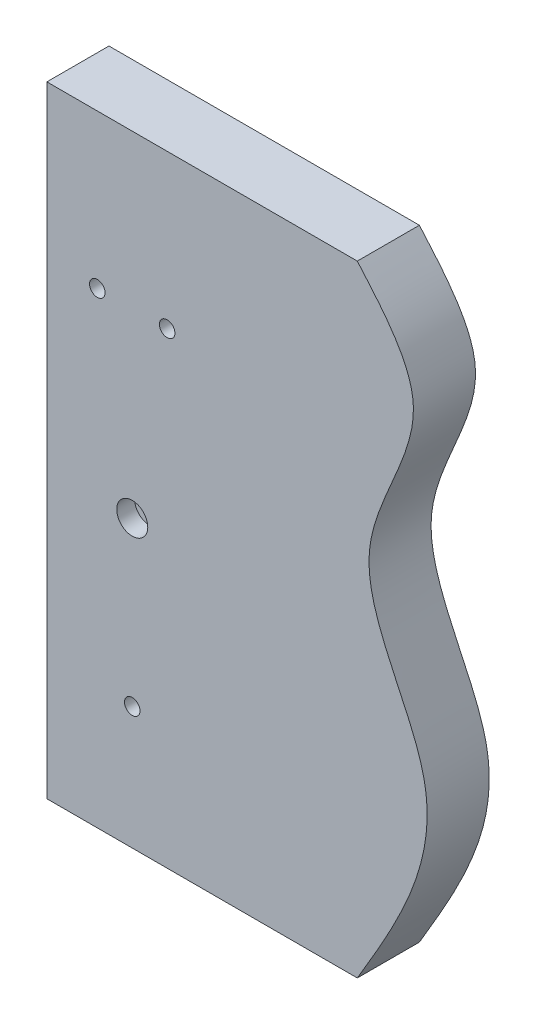
ISO-10303-21;
HEADER;
FILE_DESCRIPTION(('STEP AP214'),'2;1');
FILE_NAME('part.step','',(''),(''),'','','');
FILE_SCHEMA(('AUTOMOTIVE_DESIGN { 1 0 10303 214 1 1 1 1 }'));
ENDSEC;
DATA;
#1=APPLICATION_CONTEXT('core data for automotive mechanical design processes');
#2=APPLICATION_PROTOCOL_DEFINITION('international standard','automotive_design',2000,#1);
#3=PRODUCT_CONTEXT('',#1,'mechanical');
#4=PRODUCT('Part','Part','',(#3));
#5=PRODUCT_RELATED_PRODUCT_CATEGORY('part','',(#4));
#6=PRODUCT_DEFINITION_FORMATION('','',#4);
#7=PRODUCT_DEFINITION_CONTEXT('part definition',#1,'design');
#8=PRODUCT_DEFINITION('design','',#6,#7);
#9=PRODUCT_DEFINITION_SHAPE('','',#8);
#10=(LENGTH_UNIT() NAMED_UNIT(*) SI_UNIT(.MILLI.,.METRE.));
#11=(NAMED_UNIT(*) PLANE_ANGLE_UNIT() SI_UNIT($,.RADIAN.));
#12=(NAMED_UNIT(*) SI_UNIT($,.STERADIAN.) SOLID_ANGLE_UNIT());
#13=UNCERTAINTY_MEASURE_WITH_UNIT(LENGTH_MEASURE(1.E-05),#10,'distance_accuracy_value','');
#14=(GEOMETRIC_REPRESENTATION_CONTEXT(3) GLOBAL_UNCERTAINTY_ASSIGNED_CONTEXT((#13)) GLOBAL_UNIT_ASSIGNED_CONTEXT((#10,
#11,#12)) REPRESENTATION_CONTEXT('',''));
#15=CARTESIAN_POINT('',(0.,0.,0.));
#16=DIRECTION('',(0.,0.,1.));
#17=DIRECTION('',(1.,0.,0.));
#18=AXIS2_PLACEMENT_3D('',#15,#16,#17);
#19=CARTESIAN_POINT('',(-147.,-116.5,-8.5));
#20=DIRECTION('',(0.,-1.,0.));
#21=DIRECTION('',(1.,0.,0.));
#22=AXIS2_PLACEMENT_3D('',#19,#20,#21);
#23=PLANE('',#22);
#24=DIRECTION('',(1.,0.,0.));
#25=VECTOR('',#24,1.);
#26=CARTESIAN_POINT('',(-147.,-116.5,-8.5));
#27=LINE('',#26,#25);
#28=CARTESIAN_POINT('',(-92.8205505282296,-116.5,-8.5));
#29=VERTEX_POINT('',#28);
#30=CARTESIAN_POINT('',(-70.,-116.5,-8.5));
#31=VERTEX_POINT('',#30);
#32=EDGE_CURVE('E142',#29,#31,#27,.T.);
#33=ORIENTED_EDGE('',*,*,#32,.F.);
#34=DIRECTION('',(0.,0.,1.));
#35=VECTOR('',#34,1.);
#36=CARTESIAN_POINT('',(-92.8205505282296,-116.5,-20.));
#37=LINE('',#36,#35);
#38=CARTESIAN_POINT('',(-92.8205505282296,-116.5,8.5));
#39=VERTEX_POINT('',#38);
#40=EDGE_CURVE('E134',#29,#39,#37,.T.);
#41=ORIENTED_EDGE('',*,*,#40,.T.);
#42=DIRECTION('',(1.,0.,0.));
#43=VECTOR('',#42,1.);
#44=CARTESIAN_POINT('',(-147.,-116.5,8.5));
#45=LINE('',#44,#43);
#46=CARTESIAN_POINT('',(-70.,-116.5,8.5));
#47=VERTEX_POINT('',#46);
#48=EDGE_CURVE('E140',#39,#47,#45,.T.);
#49=ORIENTED_EDGE('',*,*,#48,.T.);
#50=DIRECTION('',(0.,0.,1.));
#51=VECTOR('',#50,1.);
#52=CARTESIAN_POINT('',(-70.,-116.5,-8.5));
#53=LINE('',#52,#51);
#54=EDGE_CURVE('E173',#31,#47,#53,.T.);
#55=ORIENTED_EDGE('',*,*,#54,.F.);
#56=EDGE_LOOP('',(#33,#41,#49,#55));
#57=FACE_BOUND('',#56,.T.);
#58=ADVANCED_FACE('F33',(#57),#23,.F.);
#59=CARTESIAN_POINT('',(-147.,-150.,-11.));
#60=DIRECTION('',(-1.,0.,0.));
#61=DIRECTION('',(0.,0.,1.));
#62=AXIS2_PLACEMENT_3D('',#59,#60,#61);
#63=PLANE('',#62);
#64=DIRECTION('',(0.,-1.,0.));
#65=VECTOR('',#64,1.);
#66=CARTESIAN_POINT('',(-147.,80.,-11.));
#67=LINE('',#66,#65);
#68=CARTESIAN_POINT('',(-147.,80.,-11.));
#69=VERTEX_POINT('',#68);
#70=CARTESIAN_POINT('',(-147.,-150.,-11.));
#71=VERTEX_POINT('',#70);
#72=EDGE_CURVE('E175',#69,#71,#67,.T.);
#73=ORIENTED_EDGE('',*,*,#72,.T.);
#74=DIRECTION('',(0.,0.,1.));
#75=VECTOR('',#74,1.);
#76=CARTESIAN_POINT('',(-147.,-150.,-11.));
#77=LINE('',#76,#75);
#78=CARTESIAN_POINT('',(-147.,-150.,11.));
#79=VERTEX_POINT('',#78);
#80=EDGE_CURVE('E178',#71,#79,#77,.T.);
#81=ORIENTED_EDGE('',*,*,#80,.T.);
#82=DIRECTION('',(0.,1.,0.));
#83=VECTOR('',#82,1.);
#84=CARTESIAN_POINT('',(-147.,80.,11.));
#85=LINE('',#84,#83);
#86=CARTESIAN_POINT('',(-147.,80.,11.));
#87=VERTEX_POINT('',#86);
#88=EDGE_CURVE('E182',#79,#87,#85,.T.);
#89=ORIENTED_EDGE('',*,*,#88,.T.);
#90=DIRECTION('',(0.,0.,-1.));
#91=VECTOR('',#90,1.);
#92=CARTESIAN_POINT('',(-147.,80.,-11.));
#93=LINE('',#92,#91);
#94=EDGE_CURVE('E185',#87,#69,#93,.T.);
#95=ORIENTED_EDGE('',*,*,#94,.T.);
#96=EDGE_LOOP('',(#73,#81,#89,#95));
#97=FACE_BOUND('',#96,.T.);
#98=DIRECTION('',(0.,0.,1.));
#99=VECTOR('',#98,1.);
#100=CARTESIAN_POINT('',(-147.,-116.5,-8.5));
#101=LINE('',#100,#99);
#102=CARTESIAN_POINT('',(-147.,-116.5,-8.5));
#103=VERTEX_POINT('',#102);
#104=CARTESIAN_POINT('',(-147.,-116.5,8.5));
#105=VERTEX_POINT('',#104);
#106=EDGE_CURVE('E165',#103,#105,#101,.T.);
#107=ORIENTED_EDGE('',*,*,#106,.F.);
#108=DIRECTION('',(0.,-1.,0.));
#109=VECTOR('',#108,1.);
#110=CARTESIAN_POINT('',(-147.,-116.5,-8.5));
#111=LINE('',#110,#109);
#112=CARTESIAN_POINT('',(-147.,46.5,-8.5));
#113=VERTEX_POINT('',#112);
#114=EDGE_CURVE('E157',#113,#103,#111,.T.);
#115=ORIENTED_EDGE('',*,*,#114,.F.);
#116=DIRECTION('',(0.,0.,1.));
#117=VECTOR('',#116,1.);
#118=CARTESIAN_POINT('',(-147.,46.5,-8.5));
#119=LINE('',#118,#117);
#120=CARTESIAN_POINT('',(-147.,46.5,8.5));
#121=VERTEX_POINT('',#120);
#122=EDGE_CURVE('E168',#113,#121,#119,.T.);
#123=ORIENTED_EDGE('',*,*,#122,.T.);
#124=DIRECTION('',(0.,-1.,0.));
#125=VECTOR('',#124,1.);
#126=CARTESIAN_POINT('',(-147.,-116.5,8.5));
#127=LINE('',#126,#125);
#128=EDGE_CURVE('E162',#121,#105,#127,.T.);
#129=ORIENTED_EDGE('',*,*,#128,.T.);
#130=EDGE_LOOP('',(#107,#115,#123,#129));
#131=FACE_BOUND('',#130,.T.);
#132=ADVANCED_FACE('F236',(#97,#131),#63,.T.);
#133=CARTESIAN_POINT('',(-150.,200.,20.));
#134=DIRECTION('',(1.,0.,0.));
#135=DIRECTION('',(0.,0.,-1.));
#136=AXIS2_PLACEMENT_3D('',#133,#134,#135);
#137=PLANE('',#136);
#138=DIRECTION('',(0.,0.,1.));
#139=VECTOR('',#138,1.);
#140=CARTESIAN_POINT('',(-150.,-150.,-11.));
#141=LINE('',#140,#139);
#142=CARTESIAN_POINT('',(-150.,-150.,-11.));
#143=VERTEX_POINT('',#142);
#144=CARTESIAN_POINT('',(-150.,-150.,11.));
#145=VERTEX_POINT('',#144);
#146=EDGE_CURVE('E190',#143,#145,#141,.T.);
#147=ORIENTED_EDGE('',*,*,#146,.F.);
#148=DIRECTION('',(0.,-1.,0.));
#149=VECTOR('',#148,1.);
#150=CARTESIAN_POINT('',(-150.,80.,-11.));
#151=LINE('',#150,#149);
#152=CARTESIAN_POINT('',(-150.,80.,-11.));
#153=VERTEX_POINT('',#152);
#154=EDGE_CURVE('E167',#153,#143,#151,.T.);
#155=ORIENTED_EDGE('',*,*,#154,.F.);
#156=DIRECTION('',(0.,0.,-1.));
#157=VECTOR('',#156,1.);
#158=CARTESIAN_POINT('',(-150.,80.,-11.));
#159=LINE('',#158,#157);
#160=CARTESIAN_POINT('',(-150.,80.,11.));
#161=VERTEX_POINT('',#160);
#162=EDGE_CURVE('E179',#161,#153,#159,.T.);
#163=ORIENTED_EDGE('',*,*,#162,.F.);
#164=DIRECTION('',(0.,1.,0.));
#165=VECTOR('',#164,1.);
#166=CARTESIAN_POINT('',(-150.,80.,11.));
#167=LINE('',#166,#165);
#168=EDGE_CURVE('E193',#145,#161,#167,.T.);
#169=ORIENTED_EDGE('',*,*,#168,.F.);
#170=EDGE_LOOP('',(#147,#155,#163,#169));
#171=FACE_BOUND('',#170,.T.);
#172=DIRECTION('',(0.,-1.,0.));
#173=VECTOR('',#172,1.);
#174=CARTESIAN_POINT('',(-150.,200.,-20.));
#175=LINE('',#174,#173);
#176=CARTESIAN_POINT('',(-150.,200.,-20.));
#177=VERTEX_POINT('',#176);
#178=CARTESIAN_POINT('',(-150.,-200.,-20.));
#179=VERTEX_POINT('',#178);
#180=EDGE_CURVE('E200',#177,#179,#175,.T.);
#181=ORIENTED_EDGE('',*,*,#180,.T.);
#182=DIRECTION('',(0.,0.,-1.));
#183=VECTOR('',#182,1.);
#184=CARTESIAN_POINT('',(-150.,-200.,20.));
#185=LINE('',#184,#183);
#186=CARTESIAN_POINT('',(-150.,-200.,20.));
#187=VERTEX_POINT('',#186);
#188=EDGE_CURVE('E41',#187,#179,#185,.T.);
#189=ORIENTED_EDGE('',*,*,#188,.F.);
#190=DIRECTION('',(0.,-1.,0.));
#191=VECTOR('',#190,1.);
#192=CARTESIAN_POINT('',(-150.,200.,20.));
#193=LINE('',#192,#191);
#194=CARTESIAN_POINT('',(-150.,200.,20.));
#195=VERTEX_POINT('',#194);
#196=EDGE_CURVE('E207',#195,#187,#193,.T.);
#197=ORIENTED_EDGE('',*,*,#196,.F.);
#198=DIRECTION('',(0.,0.,-1.));
#199=VECTOR('',#198,1.);
#200=CARTESIAN_POINT('',(-150.,200.,20.));
#201=LINE('',#200,#199);
#202=EDGE_CURVE('E431',#195,#177,#201,.T.);
#203=ORIENTED_EDGE('',*,*,#202,.T.);
#204=EDGE_LOOP('',(#181,#189,#197,#203));
#205=FACE_BOUND('',#204,.T.);
#206=ADVANCED_FACE('F35',(#171,#205),#137,.F.);
#207=CARTESIAN_POINT('',(-150.,-200.,20.));
#208=DIRECTION('',(0.,1.,0.));
#209=DIRECTION('',(0.,0.,1.));
#210=AXIS2_PLACEMENT_3D('',#207,#208,#209);
#211=PLANE('',#210);
#212=DIRECTION('',(1.,0.,0.));
#213=VECTOR('',#212,1.);
#214=CARTESIAN_POINT('',(-150.,-200.,-20.));
#215=LINE('',#214,#213);
#216=CARTESIAN_POINT('',(50.,-200.,-20.));
#217=VERTEX_POINT('',#216);
#218=EDGE_CURVE('E420',#179,#217,#215,.T.);
#219=ORIENTED_EDGE('',*,*,#218,.T.);
#220=DIRECTION('',(0.,0.,-1.));
#221=VECTOR('',#220,1.);
#222=CARTESIAN_POINT('',(50.,-200.,20.));
#223=LINE('',#222,#221);
#224=CARTESIAN_POINT('',(50.,-200.,20.));
#225=VERTEX_POINT('',#224);
#226=EDGE_CURVE('E334',#225,#217,#223,.T.);
#227=ORIENTED_EDGE('',*,*,#226,.F.);
#228=DIRECTION('',(1.,0.,0.));
#229=VECTOR('',#228,1.);
#230=CARTESIAN_POINT('',(-150.,-200.,20.));
#231=LINE('',#230,#229);
#232=EDGE_CURVE('E210',#187,#225,#231,.T.);
#233=ORIENTED_EDGE('',*,*,#232,.F.);
#234=ORIENTED_EDGE('',*,*,#188,.T.);
#235=EDGE_LOOP('',(#219,#227,#233,#234));
#236=FACE_BOUND('',#235,.T.);
#237=ADVANCED_FACE('F228',(#236),#211,.F.);
#238=CARTESIAN_POINT('',(50.,-200.,20.));
#239=CARTESIAN_POINT('',(75.8926121429316,-156.299492504264,20.));
#240=CARTESIAN_POINT('',(123.473848535243,-75.9937988901806,20.));
#241=CARTESIAN_POINT('',(27.2782564010871,35.2365570661427,20.));
#242=CARTESIAN_POINT('',(108.79400955081,132.296562906832,20.));
#243=CARTESIAN_POINT('',(66.8795606617927,180.562572919298,20.));
#244=CARTESIAN_POINT('',(50.,200.,20.));
#245=B_SPLINE_CURVE_WITH_KNOTS('',3,(#238,#239,#240,#241,#242,#243,#244),.UNSPECIFIED.,.F.,.F.,
(4,1,1,1,4),(0.,0.322833315670229,0.593250623900925,0.836196086314051,1.),.UNSPECIFIED.);
#246=DIRECTION('',(0.,0.,-1.));
#247=VECTOR('',#246,1.);
#248=SURFACE_OF_LINEAR_EXTRUSION('',#245,#247);
#249=CARTESIAN_POINT('',(50.,-200.,-20.));
#250=CARTESIAN_POINT('',(75.8926121429316,-156.299492504264,-20.));
#251=CARTESIAN_POINT('',(123.473848535243,-75.9937988901806,-20.));
#252=CARTESIAN_POINT('',(27.2782564010871,35.2365570661427,-20.));
#253=CARTESIAN_POINT('',(108.79400955081,132.296562906832,-20.));
#254=CARTESIAN_POINT('',(66.8795606617927,180.562572919298,-20.));
#255=CARTESIAN_POINT('',(50.,200.,-20.));
#256=B_SPLINE_CURVE_WITH_KNOTS('',3,(#249,#250,#251,#252,#253,#254,#255),.UNSPECIFIED.,.F.,.F.,
(4,1,1,1,4),(0.,0.322833315670229,0.593250623900925,0.836196086314051,1.),.UNSPECIFIED.);
#257=CARTESIAN_POINT('',(50.,200.,-20.));
#258=VERTEX_POINT('',#257);
#259=EDGE_CURVE('E421',#217,#258,#256,.T.);
#260=ORIENTED_EDGE('',*,*,#259,.T.);
#261=DIRECTION('',(0.,0.,-1.));
#262=VECTOR('',#261,1.);
#263=CARTESIAN_POINT('',(50.,200.,20.));
#264=LINE('',#263,#262);
#265=CARTESIAN_POINT('',(50.,200.,20.));
#266=VERTEX_POINT('',#265);
#267=EDGE_CURVE('E337',#266,#258,#264,.T.);
#268=ORIENTED_EDGE('',*,*,#267,.F.);
#269=EDGE_CURVE('E213',#225,#266,#245,.T.);
#270=ORIENTED_EDGE('',*,*,#269,.F.);
#271=ORIENTED_EDGE('',*,*,#226,.T.);
#272=EDGE_LOOP('',(#260,#268,#270,#271));
#273=FACE_BOUND('',#272,.T.);
#274=ADVANCED_FACE('F224',(#273),#248,.F.);
#275=CARTESIAN_POINT('',(-150.,200.,20.));
#276=DIRECTION('',(0.,-1.,0.));
#277=DIRECTION('',(0.,0.,-1.));
#278=AXIS2_PLACEMENT_3D('',#275,#276,#277);
#279=PLANE('',#278);
#280=DIRECTION('',(-1.,0.,0.));
#281=VECTOR('',#280,1.);
#282=CARTESIAN_POINT('',(-150.,200.,-20.));
#283=LINE('',#282,#281);
#284=EDGE_CURVE('E211',#258,#177,#283,.T.);
#285=ORIENTED_EDGE('',*,*,#284,.T.);
#286=ORIENTED_EDGE('',*,*,#202,.F.);
#287=DIRECTION('',(-1.,0.,0.));
#288=VECTOR('',#287,1.);
#289=CARTESIAN_POINT('',(-150.,200.,20.));
#290=LINE('',#289,#288);
#291=EDGE_CURVE('E218',#266,#195,#290,.T.);
#292=ORIENTED_EDGE('',*,*,#291,.F.);
#293=ORIENTED_EDGE('',*,*,#267,.T.);
#294=EDGE_LOOP('',(#285,#286,#292,#293));
#295=FACE_BOUND('',#294,.T.);
#296=ADVANCED_FACE('F227',(#295),#279,.F.);
#297=CARTESIAN_POINT('',(64.7438582512238,2.07966306238669,20.));
#298=DIRECTION('',(0.,0.,1.));
#299=DIRECTION('',(1.,0.,0.));
#300=AXIS2_PLACEMENT_3D('',#297,#298,#299);
#301=PLANE('',#300);
#302=CARTESIAN_POINT('',(-72.5,101.,20.));
#303=DIRECTION('',(0.,0.,1.));
#304=DIRECTION('',(1.,0.,0.));
#305=AXIS2_PLACEMENT_3D('',#302,#303,#304);
#306=CIRCLE('',#305,5.00000000000001);
#307=CARTESIAN_POINT('',(-67.5,101.,20.));
#308=VERTEX_POINT('',#307);
#309=EDGE_CURVE('E299',#308,#308,#306,.T.);
#310=ORIENTED_EDGE('',*,*,#309,.F.);
#311=EDGE_LOOP('',(#310));
#312=FACE_BOUND('',#311,.T.);
#313=CARTESIAN_POINT('',(-95.,-121.,20.));
#314=DIRECTION('',(0.,0.,1.));
#315=DIRECTION('',(1.,0.,0.));
#316=AXIS2_PLACEMENT_3D('',#313,#314,#315);
#317=CIRCLE('',#316,5.00000000000001);
#318=CARTESIAN_POINT('',(-90.,-121.,20.));
#319=VERTEX_POINT('',#318);
#320=EDGE_CURVE('E293',#319,#319,#317,.T.);
#321=ORIENTED_EDGE('',*,*,#320,.F.);
#322=EDGE_LOOP('',(#321));
#323=FACE_BOUND('',#322,.T.);
#324=CARTESIAN_POINT('',(-117.5,101.,20.));
#325=DIRECTION('',(0.,0.,1.));
#326=DIRECTION('',(1.,0.,0.));
#327=AXIS2_PLACEMENT_3D('',#324,#325,#326);
#328=CIRCLE('',#327,5.00000000000001);
#329=CARTESIAN_POINT('',(-112.5,101.,20.));
#330=VERTEX_POINT('',#329);
#331=EDGE_CURVE('E285',#330,#330,#328,.T.);
#332=ORIENTED_EDGE('',*,*,#331,.F.);
#333=EDGE_LOOP('',(#332));
#334=FACE_BOUND('',#333,.T.);
#335=CARTESIAN_POINT('',(-95.,-16.,20.));
#336=DIRECTION('',(0.,0.,1.));
#337=DIRECTION('',(1.,0.,0.));
#338=AXIS2_PLACEMENT_3D('',#335,#336,#337);
#339=CIRCLE('',#338,9.99999999999999);
#340=CARTESIAN_POINT('',(-85.,-16.,20.));
#341=VERTEX_POINT('',#340);
#342=EDGE_CURVE('E278',#341,#341,#339,.T.);
#343=ORIENTED_EDGE('',*,*,#342,.F.);
#344=EDGE_LOOP('',(#343));
#345=FACE_BOUND('',#344,.T.);
#346=ORIENTED_EDGE('',*,*,#196,.T.);
#347=ORIENTED_EDGE('',*,*,#232,.T.);
#348=ORIENTED_EDGE('',*,*,#269,.T.);
#349=ORIENTED_EDGE('',*,*,#291,.T.);
#350=EDGE_LOOP('',(#346,#347,#348,#349));
#351=FACE_BOUND('',#350,.T.);
#352=ADVANCED_FACE('F314',(#312,#323,#334,#345,#351),#301,.T.);
#353=CARTESIAN_POINT('',(64.7438582512238,2.07966306238669,-20.));
#354=DIRECTION('',(0.,0.,1.));
#355=DIRECTION('',(1.,0.,0.));
#356=AXIS2_PLACEMENT_3D('',#353,#354,#355);
#357=PLANE('',#356);
#358=CARTESIAN_POINT('',(-72.5,101.,-20.));
#359=DIRECTION('',(0.,0.,1.));
#360=DIRECTION('',(1.,0.,0.));
#361=AXIS2_PLACEMENT_3D('',#358,#359,#360);
#362=CIRCLE('',#361,5.00000000000001);
#363=CARTESIAN_POINT('',(-67.5,101.,-20.));
#364=VERTEX_POINT('',#363);
#365=EDGE_CURVE('E296',#364,#364,#362,.T.);
#366=ORIENTED_EDGE('',*,*,#365,.T.);
#367=EDGE_LOOP('',(#366));
#368=FACE_BOUND('',#367,.T.);
#369=CARTESIAN_POINT('',(-95.,-121.,-20.));
#370=DIRECTION('',(0.,0.,1.));
#371=DIRECTION('',(1.,0.,0.));
#372=AXIS2_PLACEMENT_3D('',#369,#370,#371);
#373=CIRCLE('',#372,5.00000000000001);
#374=CARTESIAN_POINT('',(-90.,-121.,-20.));
#375=VERTEX_POINT('',#374);
#376=EDGE_CURVE('E292',#375,#375,#373,.T.);
#377=ORIENTED_EDGE('',*,*,#376,.T.);
#378=EDGE_LOOP('',(#377));
#379=FACE_BOUND('',#378,.T.);
#380=CARTESIAN_POINT('',(-117.5,101.,-20.));
#381=DIRECTION('',(0.,0.,1.));
#382=DIRECTION('',(1.,0.,0.));
#383=AXIS2_PLACEMENT_3D('',#380,#381,#382);
#384=CIRCLE('',#383,5.00000000000001);
#385=CARTESIAN_POINT('',(-112.5,101.,-20.));
#386=VERTEX_POINT('',#385);
#387=EDGE_CURVE('E282',#386,#386,#384,.T.);
#388=ORIENTED_EDGE('',*,*,#387,.T.);
#389=EDGE_LOOP('',(#388));
#390=FACE_BOUND('',#389,.T.);
#391=CARTESIAN_POINT('',(-95.,-16.,-20.));
#392=DIRECTION('',(0.,0.,1.));
#393=DIRECTION('',(1.,0.,0.));
#394=AXIS2_PLACEMENT_3D('',#391,#392,#393);
#395=CIRCLE('',#394,9.99999999999999);
#396=CARTESIAN_POINT('',(-85.,-16.,-20.));
#397=VERTEX_POINT('',#396);
#398=EDGE_CURVE('E281',#397,#397,#395,.T.);
#399=ORIENTED_EDGE('',*,*,#398,.T.);
#400=EDGE_LOOP('',(#399));
#401=FACE_BOUND('',#400,.T.);
#402=ORIENTED_EDGE('',*,*,#180,.F.);
#403=ORIENTED_EDGE('',*,*,#284,.F.);
#404=ORIENTED_EDGE('',*,*,#259,.F.);
#405=ORIENTED_EDGE('',*,*,#218,.F.);
#406=EDGE_LOOP('',(#402,#403,#404,#405));
#407=FACE_BOUND('',#406,.T.);
#408=ADVANCED_FACE('F305',(#368,#379,#390,#401,#407),#357,.F.);
#409=CARTESIAN_POINT('',(-147.,80.,-11.));
#410=DIRECTION('',(0.,0.,-1.));
#411=DIRECTION('',(0.,1.,0.));
#412=AXIS2_PLACEMENT_3D('',#409,#410,#411);
#413=PLANE('',#412);
#414=ORIENTED_EDGE('',*,*,#154,.T.);
#415=DIRECTION('',(-1.,0.,0.));
#416=VECTOR('',#415,1.);
#417=CARTESIAN_POINT('',(-147.,-150.,-11.));
#418=LINE('',#417,#416);
#419=EDGE_CURVE('E188',#71,#143,#418,.T.);
#420=ORIENTED_EDGE('',*,*,#419,.F.);
#421=ORIENTED_EDGE('',*,*,#72,.F.);
#422=DIRECTION('',(-1.,0.,0.));
#423=VECTOR('',#422,1.);
#424=CARTESIAN_POINT('',(-147.,80.,-11.));
#425=LINE('',#424,#423);
#426=EDGE_CURVE('E198',#69,#153,#425,.T.);
#427=ORIENTED_EDGE('',*,*,#426,.T.);
#428=EDGE_LOOP('',(#414,#420,#421,#427));
#429=FACE_BOUND('',#428,.T.);
#430=ADVANCED_FACE('F415',(#429),#413,.F.);
#431=CARTESIAN_POINT('',(-147.,80.,-11.));
#432=DIRECTION('',(0.,1.,0.));
#433=DIRECTION('',(-1.,0.,0.));
#434=AXIS2_PLACEMENT_3D('',#431,#432,#433);
#435=PLANE('',#434);
#436=ORIENTED_EDGE('',*,*,#162,.T.);
#437=ORIENTED_EDGE('',*,*,#426,.F.);
#438=ORIENTED_EDGE('',*,*,#94,.F.);
#439=DIRECTION('',(-1.,0.,0.));
#440=VECTOR('',#439,1.);
#441=CARTESIAN_POINT('',(-147.,80.,11.));
#442=LINE('',#441,#440);
#443=EDGE_CURVE('E201',#87,#161,#442,.T.);
#444=ORIENTED_EDGE('',*,*,#443,.T.);
#445=EDGE_LOOP('',(#436,#437,#438,#444));
#446=FACE_BOUND('',#445,.T.);
#447=ADVANCED_FACE('F456',(#446),#435,.F.);
#448=CARTESIAN_POINT('',(-147.,80.,11.));
#449=DIRECTION('',(0.,0.,1.));
#450=DIRECTION('',(0.,-1.,0.));
#451=AXIS2_PLACEMENT_3D('',#448,#449,#450);
#452=PLANE('',#451);
#453=ORIENTED_EDGE('',*,*,#168,.T.);
#454=ORIENTED_EDGE('',*,*,#443,.F.);
#455=ORIENTED_EDGE('',*,*,#88,.F.);
#456=DIRECTION('',(-1.,0.,0.));
#457=VECTOR('',#456,1.);
#458=CARTESIAN_POINT('',(-147.,-150.,11.));
#459=LINE('',#458,#457);
#460=EDGE_CURVE('E203',#79,#145,#459,.T.);
#461=ORIENTED_EDGE('',*,*,#460,.T.);
#462=EDGE_LOOP('',(#453,#454,#455,#461));
#463=FACE_BOUND('',#462,.T.);
#464=ADVANCED_FACE('F258',(#463),#452,.F.);
#465=CARTESIAN_POINT('',(-147.,-150.,-11.));
#466=DIRECTION('',(0.,-1.,0.));
#467=DIRECTION('',(1.,0.,0.));
#468=AXIS2_PLACEMENT_3D('',#465,#466,#467);
#469=PLANE('',#468);
#470=ORIENTED_EDGE('',*,*,#146,.T.);
#471=ORIENTED_EDGE('',*,*,#460,.F.);
#472=ORIENTED_EDGE('',*,*,#80,.F.);
#473=ORIENTED_EDGE('',*,*,#419,.T.);
#474=EDGE_LOOP('',(#470,#471,#472,#473));
#475=FACE_BOUND('',#474,.T.);
#476=ADVANCED_FACE('F249',(#475),#469,.F.);
#477=CARTESIAN_POINT('',(-97.1794494717704,-116.5,8.5));
#478=VERTEX_POINT('',#477);
#479=EDGE_CURVE('E54',#105,#478,#45,.T.);
#480=ORIENTED_EDGE('',*,*,#479,.T.);
#481=DIRECTION('',(0.,0.,1.));
#482=VECTOR('',#481,1.);
#483=CARTESIAN_POINT('',(-97.1794494717704,-116.5,-20.));
#484=LINE('',#483,#482);
#485=CARTESIAN_POINT('',(-97.1794494717704,-116.5,-8.5));
#486=VERTEX_POINT('',#485);
#487=EDGE_CURVE('E48',#478,#486,#484,.F.);
#488=ORIENTED_EDGE('',*,*,#487,.T.);
#489=EDGE_CURVE('E263',#103,#486,#27,.T.);
#490=ORIENTED_EDGE('',*,*,#489,.F.);
#491=ORIENTED_EDGE('',*,*,#106,.T.);
#492=EDGE_LOOP('',(#480,#488,#490,#491));
#493=FACE_BOUND('',#492,.T.);
#494=ADVANCED_FACE('F240',(#493),#23,.F.);
#495=CARTESIAN_POINT('',(-147.,46.5,-8.5));
#496=DIRECTION('',(0.,1.,0.));
#497=DIRECTION('',(-1.,0.,0.));
#498=AXIS2_PLACEMENT_3D('',#495,#496,#497);
#499=PLANE('',#498);
#500=DIRECTION('',(-1.,0.,0.));
#501=VECTOR('',#500,1.);
#502=CARTESIAN_POINT('',(-147.,46.5,8.5));
#503=LINE('',#502,#501);
#504=CARTESIAN_POINT('',(-70.,46.5,8.5));
#505=VERTEX_POINT('',#504);
#506=EDGE_CURVE('E160',#505,#121,#503,.T.);
#507=ORIENTED_EDGE('',*,*,#506,.T.);
#508=ORIENTED_EDGE('',*,*,#122,.F.);
#509=DIRECTION('',(-1.,0.,0.));
#510=VECTOR('',#509,1.);
#511=CARTESIAN_POINT('',(-147.,46.5,-8.5));
#512=LINE('',#511,#510);
#513=CARTESIAN_POINT('',(-70.,46.5,-8.5));
#514=VERTEX_POINT('',#513);
#515=EDGE_CURVE('E274',#514,#113,#512,.T.);
#516=ORIENTED_EDGE('',*,*,#515,.F.);
#517=DIRECTION('',(0.,0.,1.));
#518=VECTOR('',#517,1.);
#519=CARTESIAN_POINT('',(-70.,46.5,-8.5));
#520=LINE('',#519,#518);
#521=EDGE_CURVE('E171',#514,#505,#520,.T.);
#522=ORIENTED_EDGE('',*,*,#521,.T.);
#523=EDGE_LOOP('',(#507,#508,#516,#522));
#524=FACE_BOUND('',#523,.T.);
#525=ADVANCED_FACE('F248',(#524),#499,.F.);
#526=CARTESIAN_POINT('',(-70.,-116.5,-8.5));
#527=DIRECTION('',(1.,0.,0.));
#528=DIRECTION('',(0.,0.,-1.));
#529=AXIS2_PLACEMENT_3D('',#526,#527,#528);
#530=PLANE('',#529);
#531=DIRECTION('',(0.,1.,0.));
#532=VECTOR('',#531,1.);
#533=CARTESIAN_POINT('',(-70.,-116.5,8.5));
#534=LINE('',#533,#532);
#535=EDGE_CURVE('E149',#47,#505,#534,.T.);
#536=ORIENTED_EDGE('',*,*,#535,.T.);
#537=ORIENTED_EDGE('',*,*,#521,.F.);
#538=DIRECTION('',(0.,1.,0.));
#539=VECTOR('',#538,1.);
#540=CARTESIAN_POINT('',(-70.,-116.5,-8.5));
#541=LINE('',#540,#539);
#542=EDGE_CURVE('E271',#31,#514,#541,.T.);
#543=ORIENTED_EDGE('',*,*,#542,.F.);
#544=ORIENTED_EDGE('',*,*,#54,.T.);
#545=EDGE_LOOP('',(#536,#537,#543,#544));
#546=FACE_BOUND('',#545,.T.);
#547=ADVANCED_FACE('F255',(#546),#530,.F.);
#548=CARTESIAN_POINT('',(-70.,-116.5,-8.5));
#549=DIRECTION('',(0.,0.,1.));
#550=DIRECTION('',(1.,0.,0.));
#551=AXIS2_PLACEMENT_3D('',#548,#549,#550);
#552=PLANE('',#551);
#553=CARTESIAN_POINT('',(-95.,-121.,-8.5));
#554=DIRECTION('',(0.,0.,1.));
#555=DIRECTION('',(1.,0.,0.));
#556=AXIS2_PLACEMENT_3D('',#553,#554,#555);
#557=CIRCLE('',#556,5.00000000000001);
#558=EDGE_CURVE('E143',#29,#486,#557,.T.);
#559=ORIENTED_EDGE('',*,*,#558,.F.);
#560=ORIENTED_EDGE('',*,*,#32,.T.);
#561=ORIENTED_EDGE('',*,*,#542,.T.);
#562=ORIENTED_EDGE('',*,*,#515,.T.);
#563=ORIENTED_EDGE('',*,*,#114,.T.);
#564=ORIENTED_EDGE('',*,*,#489,.T.);
#565=EDGE_LOOP('',(#559,#560,#561,#562,#563,#564));
#566=FACE_BOUND('',#565,.T.);
#567=CARTESIAN_POINT('',(-95.,-16.,-8.5));
#568=DIRECTION('',(0.,0.,1.));
#569=DIRECTION('',(1.,0.,0.));
#570=AXIS2_PLACEMENT_3D('',#567,#568,#569);
#571=CIRCLE('',#570,9.99999999999999);
#572=CARTESIAN_POINT('',(-85.,-16.,-8.5));
#573=VERTEX_POINT('',#572);
#574=EDGE_CURVE('E150',#573,#573,#571,.T.);
#575=ORIENTED_EDGE('',*,*,#574,.F.);
#576=EDGE_LOOP('',(#575));
#577=FACE_BOUND('',#576,.T.);
#578=ADVANCED_FACE('F355',(#566,#577),#552,.T.);
#579=CARTESIAN_POINT('',(-70.,-116.5,8.5));
#580=DIRECTION('',(0.,0.,1.));
#581=DIRECTION('',(1.,0.,0.));
#582=AXIS2_PLACEMENT_3D('',#579,#580,#581);
#583=PLANE('',#582);
#584=CARTESIAN_POINT('',(-95.,-16.,8.5));
#585=DIRECTION('',(0.,0.,1.));
#586=DIRECTION('',(1.,0.,0.));
#587=AXIS2_PLACEMENT_3D('',#584,#585,#586);
#588=CIRCLE('',#587,9.99999999999999);
#589=CARTESIAN_POINT('',(-85.,-16.,8.5));
#590=VERTEX_POINT('',#589);
#591=EDGE_CURVE('E153',#590,#590,#588,.T.);
#592=ORIENTED_EDGE('',*,*,#591,.T.);
#593=EDGE_LOOP('',(#592));
#594=FACE_BOUND('',#593,.T.);
#595=ORIENTED_EDGE('',*,*,#48,.F.);
#596=CARTESIAN_POINT('',(-95.,-121.,8.5));
#597=DIRECTION('',(0.,0.,1.));
#598=DIRECTION('',(1.,0.,0.));
#599=AXIS2_PLACEMENT_3D('',#596,#597,#598);
#600=CIRCLE('',#599,5.00000000000001);
#601=EDGE_CURVE('E11',#39,#478,#600,.T.);
#602=ORIENTED_EDGE('',*,*,#601,.T.);
#603=ORIENTED_EDGE('',*,*,#479,.F.);
#604=ORIENTED_EDGE('',*,*,#128,.F.);
#605=ORIENTED_EDGE('',*,*,#506,.F.);
#606=ORIENTED_EDGE('',*,*,#535,.F.);
#607=EDGE_LOOP('',(#595,#602,#603,#604,#605,#606));
#608=FACE_BOUND('',#607,.T.);
#609=ADVANCED_FACE('F146',(#594,#608),#583,.F.);
#610=CARTESIAN_POINT('',(-95.,-16.,-20.));
#611=DIRECTION('',(0.,0.,1.));
#612=DIRECTION('',(1.,0.,0.));
#613=AXIS2_PLACEMENT_3D('',#610,#611,#612);
#614=CYLINDRICAL_SURFACE('',#613,9.99999999999999);
#615=ORIENTED_EDGE('',*,*,#342,.T.);
#616=EDGE_LOOP('',(#615));
#617=FACE_BOUND('',#616,.T.);
#618=ORIENTED_EDGE('',*,*,#591,.F.);
#619=EDGE_LOOP('',(#618));
#620=FACE_BOUND('',#619,.T.);
#621=ADVANCED_FACE('F344',(#617,#620),#614,.F.);
#622=ORIENTED_EDGE('',*,*,#574,.T.);
#623=EDGE_LOOP('',(#622));
#624=FACE_BOUND('',#623,.T.);
#625=ORIENTED_EDGE('',*,*,#398,.F.);
#626=EDGE_LOOP('',(#625));
#627=FACE_BOUND('',#626,.T.);
#628=ADVANCED_FACE('F346',(#624,#627),#614,.F.);
#629=CARTESIAN_POINT('',(-117.5,101.,-20.));
#630=DIRECTION('',(0.,0.,1.));
#631=DIRECTION('',(1.,0.,0.));
#632=AXIS2_PLACEMENT_3D('',#629,#630,#631);
#633=CYLINDRICAL_SURFACE('',#632,5.00000000000001);
#634=ORIENTED_EDGE('',*,*,#387,.F.);
#635=EDGE_LOOP('',(#634));
#636=FACE_BOUND('',#635,.T.);
#637=ORIENTED_EDGE('',*,*,#331,.T.);
#638=EDGE_LOOP('',(#637));
#639=FACE_BOUND('',#638,.T.);
#640=ADVANCED_FACE('F353',(#636,#639),#633,.F.);
#641=CARTESIAN_POINT('',(-95.,-121.,-20.));
#642=DIRECTION('',(0.,0.,1.));
#643=DIRECTION('',(1.,0.,0.));
#644=AXIS2_PLACEMENT_3D('',#641,#642,#643);
#645=CYLINDRICAL_SURFACE('',#644,5.00000000000001);
#646=ORIENTED_EDGE('',*,*,#558,.T.);
#647=ORIENTED_EDGE('',*,*,#487,.F.);
#648=ORIENTED_EDGE('',*,*,#601,.F.);
#649=ORIENTED_EDGE('',*,*,#40,.F.);
#650=EDGE_LOOP('',(#646,#647,#648,#649));
#651=FACE_BOUND('',#650,.T.);
#652=ORIENTED_EDGE('',*,*,#376,.F.);
#653=EDGE_LOOP('',(#652));
#654=FACE_BOUND('',#653,.T.);
#655=ORIENTED_EDGE('',*,*,#320,.T.);
#656=EDGE_LOOP('',(#655));
#657=FACE_BOUND('',#656,.T.);
#658=ADVANCED_FACE('F132',(#651,#654,#657),#645,.F.);
#659=CARTESIAN_POINT('',(-72.5,101.,-20.));
#660=DIRECTION('',(0.,0.,1.));
#661=DIRECTION('',(1.,0.,0.));
#662=AXIS2_PLACEMENT_3D('',#659,#660,#661);
#663=CYLINDRICAL_SURFACE('',#662,5.00000000000001);
#664=ORIENTED_EDGE('',*,*,#365,.F.);
#665=EDGE_LOOP('',(#664));
#666=FACE_BOUND('',#665,.T.);
#667=ORIENTED_EDGE('',*,*,#309,.T.);
#668=EDGE_LOOP('',(#667));
#669=FACE_BOUND('',#668,.T.);
#670=ADVANCED_FACE('F308',(#666,#669),#663,.F.);
#671=CLOSED_SHELL('',(#58,#132,#206,#237,#274,#296,#352,#408,#430,#447,#464,#476,#494,#525,#547,
#578,#609,#621,#628,#640,#658,#670));
#672=MANIFOLD_SOLID_BREP('B2',#671);
#673=ADVANCED_BREP_SHAPE_REPRESENTATION('',(#18,#672),#14);
#674=SHAPE_DEFINITION_REPRESENTATION(#9,#673);
ENDSEC;
END-ISO-10303-21;
